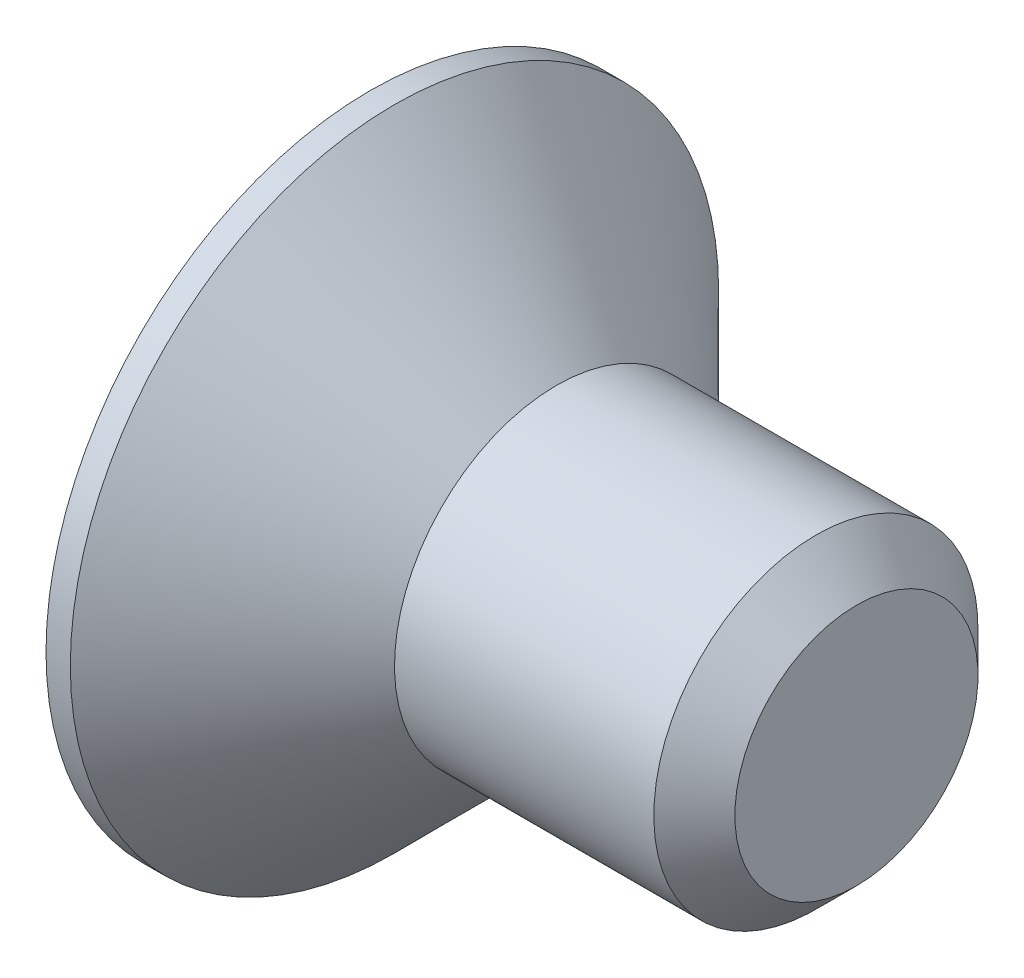
ISO-10303-21;
HEADER;
FILE_DESCRIPTION(('STEP AP214'),'2;1');
FILE_NAME('part.step','',(''),(''),'','','');
FILE_SCHEMA(('AUTOMOTIVE_DESIGN { 1 0 10303 214 1 1 1 1 }'));
ENDSEC;
DATA;
#1=APPLICATION_CONTEXT('core data for automotive mechanical design processes');
#2=APPLICATION_PROTOCOL_DEFINITION('international standard','automotive_design',2000,#1);
#3=PRODUCT_CONTEXT('',#1,'mechanical');
#4=PRODUCT('Part','Part','',(#3));
#5=PRODUCT_RELATED_PRODUCT_CATEGORY('part','',(#4));
#6=PRODUCT_DEFINITION_FORMATION('','',#4);
#7=PRODUCT_DEFINITION_CONTEXT('part definition',#1,'design');
#8=PRODUCT_DEFINITION('design','',#6,#7);
#9=PRODUCT_DEFINITION_SHAPE('','',#8);
#10=(LENGTH_UNIT() NAMED_UNIT(*) SI_UNIT(.MILLI.,.METRE.));
#11=(NAMED_UNIT(*) PLANE_ANGLE_UNIT() SI_UNIT($,.RADIAN.));
#12=(NAMED_UNIT(*) SI_UNIT($,.STERADIAN.) SOLID_ANGLE_UNIT());
#13=UNCERTAINTY_MEASURE_WITH_UNIT(LENGTH_MEASURE(1.E-05),#10,'distance_accuracy_value','');
#14=(GEOMETRIC_REPRESENTATION_CONTEXT(3) GLOBAL_UNCERTAINTY_ASSIGNED_CONTEXT((#13)) GLOBAL_UNIT_ASSIGNED_CONTEXT((#10,
#11,#12)) REPRESENTATION_CONTEXT('',''));
#15=CARTESIAN_POINT('',(0.,0.,0.));
#16=DIRECTION('',(0.,0.,1.));
#17=DIRECTION('',(1.,0.,0.));
#18=AXIS2_PLACEMENT_3D('',#15,#16,#17);
#19=CARTESIAN_POINT('',(0.,0.,0.));
#20=DIRECTION('',(-1.,0.,0.));
#21=DIRECTION('',(0.,-1.,0.));
#22=AXIS2_PLACEMENT_3D('',#19,#20,#21);
#23=PLANE('',#22);
#24=DIRECTION('',(0.,0.5,-0.866025403784439));
#25=VECTOR('',#24,1.);
#26=CARTESIAN_POINT('',(0.,0.721687836487033,1.25));
#27=LINE('',#26,#25);
#28=CARTESIAN_POINT('',(0.,0.721687836487033,1.25));
#29=VERTEX_POINT('',#28);
#30=CARTESIAN_POINT('',(0.,1.44337567297406,0.));
#31=VERTEX_POINT('',#30);
#32=EDGE_CURVE('E48',#29,#31,#27,.T.);
#33=ORIENTED_EDGE('',*,*,#32,.F.);
#34=DIRECTION('',(0.,1.,0.));
#35=VECTOR('',#34,1.);
#36=CARTESIAN_POINT('',(0.,-0.721687836487033,1.25));
#37=LINE('',#36,#35);
#38=CARTESIAN_POINT('',(0.,-0.721687836487033,1.25));
#39=VERTEX_POINT('',#38);
#40=EDGE_CURVE('E131',#39,#29,#37,.T.);
#41=ORIENTED_EDGE('',*,*,#40,.F.);
#42=DIRECTION('',(0.,0.5,0.866025403784439));
#43=VECTOR('',#42,1.);
#44=CARTESIAN_POINT('',(0.,-1.44337567297406,0.));
#45=LINE('',#44,#43);
#46=CARTESIAN_POINT('',(0.,-1.44337567297406,0.));
#47=VERTEX_POINT('',#46);
#48=EDGE_CURVE('E129',#47,#39,#45,.T.);
#49=ORIENTED_EDGE('',*,*,#48,.F.);
#50=DIRECTION('',(0.,-0.5,0.866025403784439));
#51=VECTOR('',#50,1.);
#52=CARTESIAN_POINT('',(0.,-0.721687836487032,-1.25));
#53=LINE('',#52,#51);
#54=CARTESIAN_POINT('',(0.,-0.721687836487032,-1.25));
#55=VERTEX_POINT('',#54);
#56=EDGE_CURVE('E96',#55,#47,#53,.T.);
#57=ORIENTED_EDGE('',*,*,#56,.F.);
#58=DIRECTION('',(0.,-1.,0.));
#59=VECTOR('',#58,1.);
#60=CARTESIAN_POINT('',(0.,0.721687836487033,-1.25));
#61=LINE('',#60,#59);
#62=CARTESIAN_POINT('',(0.,0.721687836487033,-1.25));
#63=VERTEX_POINT('',#62);
#64=EDGE_CURVE('E125',#63,#55,#61,.T.);
#65=ORIENTED_EDGE('',*,*,#64,.F.);
#66=DIRECTION('',(0.,-0.5,-0.866025403784439));
#67=VECTOR('',#66,1.);
#68=CARTESIAN_POINT('',(0.,1.44337567297406,0.));
#69=LINE('',#68,#67);
#70=EDGE_CURVE('E122',#31,#63,#69,.T.);
#71=ORIENTED_EDGE('',*,*,#70,.F.);
#72=EDGE_LOOP('',(#33,#41,#49,#57,#65,#71));
#73=FACE_BOUND('',#72,.T.);
#74=CARTESIAN_POINT('',(0.,0.,0.));
#75=DIRECTION('',(1.,0.,0.));
#76=DIRECTION('',(0.,1.,0.));
#77=AXIS2_PLACEMENT_3D('',#74,#75,#76);
#78=CIRCLE('',#77,4.);
#79=CARTESIAN_POINT('',(0.,4.,0.));
#80=VERTEX_POINT('',#79);
#81=EDGE_CURVE('E146',#80,#80,#78,.T.);
#82=ORIENTED_EDGE('',*,*,#81,.F.);
#83=EDGE_LOOP('',(#82));
#84=FACE_BOUND('',#83,.T.);
#85=ADVANCED_FACE('F33',(#73,#84),#23,.T.);
#86=CARTESIAN_POINT('',(6.,0.,0.));
#87=DIRECTION('',(1.,0.,0.));
#88=DIRECTION('',(0.,1.,0.));
#89=AXIS2_PLACEMENT_3D('',#86,#87,#88);
#90=CYLINDRICAL_SURFACE('',#89,4.);
#91=ORIENTED_EDGE('',*,*,#81,.T.);
#92=EDGE_LOOP('',(#91));
#93=FACE_BOUND('',#92,.T.);
#94=CARTESIAN_POINT('',(0.299999999999951,0.,0.));
#95=DIRECTION('',(1.,0.,0.));
#96=DIRECTION('',(0.,1.,0.));
#97=AXIS2_PLACEMENT_3D('',#94,#95,#96);
#98=CIRCLE('',#97,4.);
#99=CARTESIAN_POINT('',(0.299999999999951,4.,0.));
#100=VERTEX_POINT('',#99);
#101=EDGE_CURVE('E143',#100,#100,#98,.T.);
#102=ORIENTED_EDGE('',*,*,#101,.F.);
#103=EDGE_LOOP('',(#102));
#104=FACE_BOUND('',#103,.T.);
#105=ADVANCED_FACE('F166',(#93,#104),#90,.T.);
#106=CARTESIAN_POINT('',(2.3,0.,0.));
#107=DIRECTION('',(-1.,0.,0.));
#108=DIRECTION('',(0.,-1.,0.));
#109=AXIS2_PLACEMENT_3D('',#106,#107,#108);
#110=CONICAL_SURFACE('',#109,2.,0.785398163397436);
#111=ORIENTED_EDGE('',*,*,#101,.T.);
#112=EDGE_LOOP('',(#111));
#113=FACE_BOUND('',#112,.T.);
#114=CARTESIAN_POINT('',(2.3,0.,0.));
#115=DIRECTION('',(1.,0.,0.));
#116=DIRECTION('',(0.,1.,0.));
#117=AXIS2_PLACEMENT_3D('',#114,#115,#116);
#118=CIRCLE('',#117,2.);
#119=CARTESIAN_POINT('',(2.3,2.,0.));
#120=VERTEX_POINT('',#119);
#121=EDGE_CURVE('E135',#120,#120,#118,.T.);
#122=ORIENTED_EDGE('',*,*,#121,.F.);
#123=EDGE_LOOP('',(#122));
#124=FACE_BOUND('',#123,.T.);
#125=ADVANCED_FACE('F171',(#113,#124),#110,.T.);
#126=CARTESIAN_POINT('',(6.,0.,0.));
#127=DIRECTION('',(1.,0.,0.));
#128=DIRECTION('',(0.,1.,0.));
#129=AXIS2_PLACEMENT_3D('',#126,#127,#128);
#130=CYLINDRICAL_SURFACE('',#129,2.);
#131=CARTESIAN_POINT('',(5.5,0.,0.));
#132=DIRECTION('',(1.,0.,0.));
#133=DIRECTION('',(0.,1.,0.));
#134=AXIS2_PLACEMENT_3D('',#131,#132,#133);
#135=CIRCLE('',#134,2.);
#136=CARTESIAN_POINT('',(5.5,2.,0.));
#137=VERTEX_POINT('',#136);
#138=EDGE_CURVE('E11',#137,#137,#135,.F.);
#139=ORIENTED_EDGE('',*,*,#138,.T.);
#140=EDGE_LOOP('',(#139));
#141=FACE_BOUND('',#140,.T.);
#142=ORIENTED_EDGE('',*,*,#121,.T.);
#143=EDGE_LOOP('',(#142));
#144=FACE_BOUND('',#143,.T.);
#145=ADVANCED_FACE('F162',(#141,#144),#130,.T.);
#146=CARTESIAN_POINT('',(6.,2.,0.));
#147=DIRECTION('',(1.,0.,0.));
#148=DIRECTION('',(0.,1.,0.));
#149=AXIS2_PLACEMENT_3D('',#146,#147,#148);
#150=PLANE('',#149);
#151=CARTESIAN_POINT('',(6.,0.,0.));
#152=DIRECTION('',(1.,0.,0.));
#153=DIRECTION('',(0.,1.,0.));
#154=AXIS2_PLACEMENT_3D('',#151,#152,#153);
#155=CIRCLE('',#154,1.5);
#156=CARTESIAN_POINT('',(6.,1.5,0.));
#157=VERTEX_POINT('',#156);
#158=EDGE_CURVE('E41',#157,#157,#155,.T.);
#159=ORIENTED_EDGE('',*,*,#158,.T.);
#160=EDGE_LOOP('',(#159));
#161=FACE_BOUND('',#160,.T.);
#162=ADVANCED_FACE('F151',(#161),#150,.T.);
#163=CARTESIAN_POINT('',(6.,0.,0.));
#164=DIRECTION('',(-1.,0.,0.));
#165=DIRECTION('',(0.,-1.,0.));
#166=AXIS2_PLACEMENT_3D('',#163,#164,#165);
#167=CONICAL_SURFACE('',#166,1.5,0.785398163397447);
#168=ORIENTED_EDGE('',*,*,#138,.F.);
#169=EDGE_LOOP('',(#168));
#170=FACE_BOUND('',#169,.T.);
#171=ORIENTED_EDGE('',*,*,#158,.F.);
#172=EDGE_LOOP('',(#171));
#173=FACE_BOUND('',#172,.T.);
#174=ADVANCED_FACE('F35',(#170,#173),#167,.T.);
#175=CARTESIAN_POINT('',(1.8,0.721687836487032,1.25));
#176=DIRECTION('',(0.,0.866025403784438,0.5));
#177=DIRECTION('',(0.,-0.5,0.866025403784439));
#178=AXIS2_PLACEMENT_3D('',#175,#176,#177);
#179=PLANE('',#178);
#180=ORIENTED_EDGE('',*,*,#32,.T.);
#181=DIRECTION('',(-1.,0.,0.));
#182=VECTOR('',#181,1.);
#183=CARTESIAN_POINT('',(1.8,1.44337567297406,0.));
#184=LINE('',#183,#182);
#185=CARTESIAN_POINT('',(1.8,1.44337567297406,0.));
#186=VERTEX_POINT('',#185);
#187=EDGE_CURVE('E78',#186,#31,#184,.T.);
#188=ORIENTED_EDGE('',*,*,#187,.F.);
#189=DIRECTION('',(0.,0.5,-0.866025403784439));
#190=VECTOR('',#189,1.);
#191=CARTESIAN_POINT('',(1.8,0.721687836487032,1.25));
#192=LINE('',#191,#190);
#193=CARTESIAN_POINT('',(1.8,0.721687836487032,1.25));
#194=VERTEX_POINT('',#193);
#195=EDGE_CURVE('E133',#194,#186,#192,.T.);
#196=ORIENTED_EDGE('',*,*,#195,.F.);
#197=DIRECTION('',(-1.,0.,0.));
#198=VECTOR('',#197,1.);
#199=CARTESIAN_POINT('',(1.8,0.721687836487032,1.25));
#200=LINE('',#199,#198);
#201=EDGE_CURVE('E56',#194,#29,#200,.T.);
#202=ORIENTED_EDGE('',*,*,#201,.T.);
#203=EDGE_LOOP('',(#180,#188,#196,#202));
#204=FACE_BOUND('',#203,.T.);
#205=ADVANCED_FACE('F154',(#204),#179,.F.);
#206=CARTESIAN_POINT('',(1.8,-0.721687836487033,1.25));
#207=DIRECTION('',(0.,0.,1.));
#208=DIRECTION('',(0.,-1.,0.));
#209=AXIS2_PLACEMENT_3D('',#206,#207,#208);
#210=PLANE('',#209);
#211=ORIENTED_EDGE('',*,*,#40,.T.);
#212=ORIENTED_EDGE('',*,*,#201,.F.);
#213=DIRECTION('',(0.,1.,0.));
#214=VECTOR('',#213,1.);
#215=CARTESIAN_POINT('',(1.8,-0.721687836487033,1.25));
#216=LINE('',#215,#214);
#217=CARTESIAN_POINT('',(1.8,-0.721687836487033,1.25));
#218=VERTEX_POINT('',#217);
#219=EDGE_CURVE('E108',#218,#194,#216,.T.);
#220=ORIENTED_EDGE('',*,*,#219,.F.);
#221=DIRECTION('',(-1.,0.,0.));
#222=VECTOR('',#221,1.);
#223=CARTESIAN_POINT('',(1.8,-0.721687836487033,1.25));
#224=LINE('',#223,#222);
#225=EDGE_CURVE('E100',#218,#39,#224,.T.);
#226=ORIENTED_EDGE('',*,*,#225,.T.);
#227=EDGE_LOOP('',(#211,#212,#220,#226));
#228=FACE_BOUND('',#227,.T.);
#229=ADVANCED_FACE('F160',(#228),#210,.F.);
#230=CARTESIAN_POINT('',(1.8,-1.44337567297407,0.));
#231=DIRECTION('',(0.,-0.866025403784439,0.5));
#232=DIRECTION('',(0.,-0.5,-0.866025403784439));
#233=AXIS2_PLACEMENT_3D('',#230,#231,#232);
#234=PLANE('',#233);
#235=ORIENTED_EDGE('',*,*,#48,.T.);
#236=ORIENTED_EDGE('',*,*,#225,.F.);
#237=DIRECTION('',(0.,0.5,0.866025403784439));
#238=VECTOR('',#237,1.);
#239=CARTESIAN_POINT('',(1.8,-1.44337567297407,0.));
#240=LINE('',#239,#238);
#241=CARTESIAN_POINT('',(1.8,-1.44337567297407,0.));
#242=VERTEX_POINT('',#241);
#243=EDGE_CURVE('E104',#242,#218,#240,.T.);
#244=ORIENTED_EDGE('',*,*,#243,.F.);
#245=DIRECTION('',(-1.,0.,0.));
#246=VECTOR('',#245,1.);
#247=CARTESIAN_POINT('',(1.8,-1.44337567297407,0.));
#248=LINE('',#247,#246);
#249=EDGE_CURVE('E89',#242,#47,#248,.T.);
#250=ORIENTED_EDGE('',*,*,#249,.T.);
#251=EDGE_LOOP('',(#235,#236,#244,#250));
#252=FACE_BOUND('',#251,.T.);
#253=ADVANCED_FACE('F105',(#252),#234,.F.);
#254=CARTESIAN_POINT('',(1.8,-0.721687836487033,-1.25));
#255=DIRECTION('',(0.,-0.866025403784438,-0.5));
#256=DIRECTION('',(0.,0.5,-0.866025403784439));
#257=AXIS2_PLACEMENT_3D('',#254,#255,#256);
#258=PLANE('',#257);
#259=ORIENTED_EDGE('',*,*,#56,.T.);
#260=ORIENTED_EDGE('',*,*,#249,.F.);
#261=DIRECTION('',(0.,-0.5,0.866025403784439));
#262=VECTOR('',#261,1.);
#263=CARTESIAN_POINT('',(1.8,-0.721687836487033,-1.25));
#264=LINE('',#263,#262);
#265=CARTESIAN_POINT('',(1.8,-0.721687836487033,-1.25));
#266=VERTEX_POINT('',#265);
#267=EDGE_CURVE('E93',#266,#242,#264,.T.);
#268=ORIENTED_EDGE('',*,*,#267,.F.);
#269=DIRECTION('',(-1.,0.,0.));
#270=VECTOR('',#269,1.);
#271=CARTESIAN_POINT('',(1.8,-0.721687836487033,-1.25));
#272=LINE('',#271,#270);
#273=EDGE_CURVE('E101',#266,#55,#272,.T.);
#274=ORIENTED_EDGE('',*,*,#273,.T.);
#275=EDGE_LOOP('',(#259,#260,#268,#274));
#276=FACE_BOUND('',#275,.T.);
#277=ADVANCED_FACE('F91',(#276),#258,.F.);
#278=CARTESIAN_POINT('',(1.8,0.721687836487032,-1.25));
#279=DIRECTION('',(0.,0.,-1.));
#280=DIRECTION('',(-1.,0.,0.));
#281=AXIS2_PLACEMENT_3D('',#278,#279,#280);
#282=PLANE('',#281);
#283=ORIENTED_EDGE('',*,*,#64,.T.);
#284=ORIENTED_EDGE('',*,*,#273,.F.);
#285=DIRECTION('',(0.,-1.,0.));
#286=VECTOR('',#285,1.);
#287=CARTESIAN_POINT('',(1.8,0.721687836487032,-1.25));
#288=LINE('',#287,#286);
#289=CARTESIAN_POINT('',(1.8,0.721687836487032,-1.25));
#290=VERTEX_POINT('',#289);
#291=EDGE_CURVE('E114',#290,#266,#288,.T.);
#292=ORIENTED_EDGE('',*,*,#291,.F.);
#293=DIRECTION('',(-1.,0.,0.));
#294=VECTOR('',#293,1.);
#295=CARTESIAN_POINT('',(1.8,0.721687836487032,-1.25));
#296=LINE('',#295,#294);
#297=EDGE_CURVE('E138',#290,#63,#296,.T.);
#298=ORIENTED_EDGE('',*,*,#297,.T.);
#299=EDGE_LOOP('',(#283,#284,#292,#298));
#300=FACE_BOUND('',#299,.T.);
#301=ADVANCED_FACE('F185',(#300),#282,.F.);
#302=CARTESIAN_POINT('',(1.8,1.44337567297406,0.));
#303=DIRECTION('',(0.,0.866025403784439,-0.5));
#304=DIRECTION('',(0.,0.5,0.866025403784439));
#305=AXIS2_PLACEMENT_3D('',#302,#303,#304);
#306=PLANE('',#305);
#307=ORIENTED_EDGE('',*,*,#70,.T.);
#308=ORIENTED_EDGE('',*,*,#297,.F.);
#309=DIRECTION('',(0.,-0.5,-0.866025403784439));
#310=VECTOR('',#309,1.);
#311=CARTESIAN_POINT('',(1.8,1.44337567297406,0.));
#312=LINE('',#311,#310);
#313=EDGE_CURVE('E116',#186,#290,#312,.T.);
#314=ORIENTED_EDGE('',*,*,#313,.F.);
#315=ORIENTED_EDGE('',*,*,#187,.T.);
#316=EDGE_LOOP('',(#307,#308,#314,#315));
#317=FACE_BOUND('',#316,.T.);
#318=ADVANCED_FACE('F182',(#317),#306,.F.);
#319=CARTESIAN_POINT('',(1.8,0.,0.));
#320=DIRECTION('',(-1.,0.,0.));
#321=DIRECTION('',(0.,-1.,0.));
#322=AXIS2_PLACEMENT_3D('',#319,#320,#321);
#323=PLANE('',#322);
#324=ORIENTED_EDGE('',*,*,#195,.T.);
#325=ORIENTED_EDGE('',*,*,#313,.T.);
#326=ORIENTED_EDGE('',*,*,#291,.T.);
#327=ORIENTED_EDGE('',*,*,#267,.T.);
#328=ORIENTED_EDGE('',*,*,#243,.T.);
#329=ORIENTED_EDGE('',*,*,#219,.T.);
#330=EDGE_LOOP('',(#324,#325,#326,#327,#328,#329));
#331=FACE_BOUND('',#330,.T.);
#332=ADVANCED_FACE('F111',(#331),#323,.T.);
#333=CLOSED_SHELL('',(#85,#105,#125,#145,#162,#174,#205,#229,#253,#277,#301,#318,#332));
#334=MANIFOLD_SOLID_BREP('B2',#333);
#335=ADVANCED_BREP_SHAPE_REPRESENTATION('',(#18,#334),#14);
#336=SHAPE_DEFINITION_REPRESENTATION(#9,#335);
ENDSEC;
END-ISO-10303-21;
